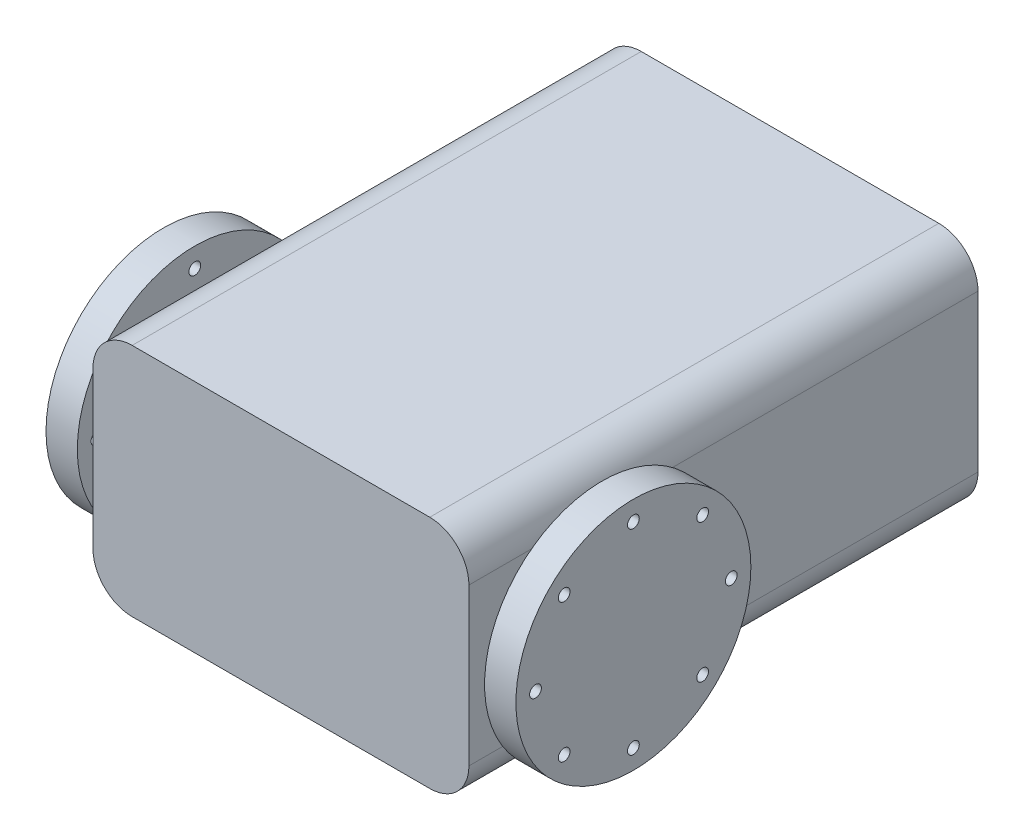
ISO-10303-21;
HEADER;
FILE_DESCRIPTION(('STEP AP214'),'2;1');
FILE_NAME('part.step','',(''),(''),'','','');
FILE_SCHEMA(('AUTOMOTIVE_DESIGN { 1 0 10303 214 1 1 1 1 }'));
ENDSEC;
DATA;
#1=APPLICATION_CONTEXT('core data for automotive mechanical design processes');
#2=APPLICATION_PROTOCOL_DEFINITION('international standard','automotive_design',2000,#1);
#3=PRODUCT_CONTEXT('',#1,'mechanical');
#4=PRODUCT('Part','Part','',(#3));
#5=PRODUCT_RELATED_PRODUCT_CATEGORY('part','',(#4));
#6=PRODUCT_DEFINITION_FORMATION('','',#4);
#7=PRODUCT_DEFINITION_CONTEXT('part definition',#1,'design');
#8=PRODUCT_DEFINITION('design','',#6,#7);
#9=PRODUCT_DEFINITION_SHAPE('','',#8);
#10=(LENGTH_UNIT() NAMED_UNIT(*) SI_UNIT(.MILLI.,.METRE.));
#11=(NAMED_UNIT(*) PLANE_ANGLE_UNIT() SI_UNIT($,.RADIAN.));
#12=(NAMED_UNIT(*) SI_UNIT($,.STERADIAN.) SOLID_ANGLE_UNIT());
#13=UNCERTAINTY_MEASURE_WITH_UNIT(LENGTH_MEASURE(1.E-05),#10,'distance_accuracy_value','');
#14=(GEOMETRIC_REPRESENTATION_CONTEXT(3) GLOBAL_UNCERTAINTY_ASSIGNED_CONTEXT((#13)) GLOBAL_UNIT_ASSIGNED_CONTEXT((#10,
#11,#12)) REPRESENTATION_CONTEXT('',''));
#15=CARTESIAN_POINT('',(0.,0.,0.));
#16=DIRECTION('',(0.,0.,1.));
#17=DIRECTION('',(1.,0.,0.));
#18=AXIS2_PLACEMENT_3D('',#15,#16,#17);
#19=CARTESIAN_POINT('',(19.,10.,32.5));
#20=DIRECTION('',(0.,0.,-1.));
#21=DIRECTION('',(-1.,0.,0.));
#22=AXIS2_PLACEMENT_3D('',#19,#20,#21);
#23=CYLINDRICAL_SURFACE('',#22,5.);
#24=CARTESIAN_POINT('',(19.,10.,-32.5));
#25=DIRECTION('',(0.,0.,1.));
#26=DIRECTION('',(-1.,0.,0.));
#27=AXIS2_PLACEMENT_3D('',#24,#25,#26);
#28=CIRCLE('',#27,5.);
#29=CARTESIAN_POINT('',(24.,10.,-32.5));
#30=VERTEX_POINT('',#29);
#31=CARTESIAN_POINT('',(19.,15.,-32.5));
#32=VERTEX_POINT('',#31);
#33=EDGE_CURVE('E131',#30,#32,#28,.T.);
#34=ORIENTED_EDGE('',*,*,#33,.T.);
#35=DIRECTION('',(0.,0.,-1.));
#36=VECTOR('',#35,1.);
#37=CARTESIAN_POINT('',(19.,15.,32.5));
#38=LINE('',#37,#36);
#39=CARTESIAN_POINT('',(19.,15.,32.5));
#40=VERTEX_POINT('',#39);
#41=EDGE_CURVE('E42',#40,#32,#38,.T.);
#42=ORIENTED_EDGE('',*,*,#41,.F.);
#43=CARTESIAN_POINT('',(19.,10.,32.5));
#44=DIRECTION('',(0.,0.,1.));
#45=DIRECTION('',(-1.,0.,0.));
#46=AXIS2_PLACEMENT_3D('',#43,#44,#45);
#47=CIRCLE('',#46,5.);
#48=CARTESIAN_POINT('',(24.,10.,32.5));
#49=VERTEX_POINT('',#48);
#50=EDGE_CURVE('E146',#49,#40,#47,.T.);
#51=ORIENTED_EDGE('',*,*,#50,.F.);
#52=DIRECTION('',(0.,0.,-1.));
#53=VECTOR('',#52,1.);
#54=CARTESIAN_POINT('',(24.,10.,32.5));
#55=LINE('',#54,#53);
#56=EDGE_CURVE('E127',#49,#30,#55,.T.);
#57=ORIENTED_EDGE('',*,*,#56,.T.);
#58=EDGE_LOOP('',(#34,#42,#51,#57));
#59=FACE_BOUND('',#58,.T.);
#60=ADVANCED_FACE('F34',(#59),#23,.T.);
#61=CARTESIAN_POINT('',(-19.,15.,32.5));
#62=DIRECTION('',(0.,-1.,0.));
#63=DIRECTION('',(0.,0.,-1.));
#64=AXIS2_PLACEMENT_3D('',#61,#62,#63);
#65=PLANE('',#64);
#66=DIRECTION('',(-1.,0.,0.));
#67=VECTOR('',#66,1.);
#68=CARTESIAN_POINT('',(-19.,15.,-32.5));
#69=LINE('',#68,#67);
#70=CARTESIAN_POINT('',(-19.,15.,-32.5));
#71=VERTEX_POINT('',#70);
#72=EDGE_CURVE('E134',#32,#71,#69,.T.);
#73=ORIENTED_EDGE('',*,*,#72,.T.);
#74=DIRECTION('',(0.,0.,-1.));
#75=VECTOR('',#74,1.);
#76=CARTESIAN_POINT('',(-19.,15.,32.5));
#77=LINE('',#76,#75);
#78=CARTESIAN_POINT('',(-19.,15.,32.5));
#79=VERTEX_POINT('',#78);
#80=EDGE_CURVE('E156',#79,#71,#77,.T.);
#81=ORIENTED_EDGE('',*,*,#80,.F.);
#82=DIRECTION('',(-1.,0.,0.));
#83=VECTOR('',#82,1.);
#84=CARTESIAN_POINT('',(-19.,15.,32.5));
#85=LINE('',#84,#83);
#86=EDGE_CURVE('E94',#40,#79,#85,.T.);
#87=ORIENTED_EDGE('',*,*,#86,.F.);
#88=ORIENTED_EDGE('',*,*,#41,.T.);
#89=EDGE_LOOP('',(#73,#81,#87,#88));
#90=FACE_BOUND('',#89,.T.);
#91=ADVANCED_FACE('F159',(#90),#65,.F.);
#92=CARTESIAN_POINT('',(-19.,10.,32.5));
#93=DIRECTION('',(0.,0.,-1.));
#94=DIRECTION('',(-1.,0.,0.));
#95=AXIS2_PLACEMENT_3D('',#92,#93,#94);
#96=CYLINDRICAL_SURFACE('',#95,5.);
#97=CARTESIAN_POINT('',(-19.,10.,-32.5));
#98=DIRECTION('',(0.,0.,1.));
#99=DIRECTION('',(1.,0.,0.));
#100=AXIS2_PLACEMENT_3D('',#97,#98,#99);
#101=CIRCLE('',#100,5.);
#102=CARTESIAN_POINT('',(-24.,10.,-32.5));
#103=VERTEX_POINT('',#102);
#104=EDGE_CURVE('E137',#71,#103,#101,.T.);
#105=ORIENTED_EDGE('',*,*,#104,.T.);
#106=DIRECTION('',(0.,0.,-1.));
#107=VECTOR('',#106,1.);
#108=CARTESIAN_POINT('',(-24.,10.,32.5));
#109=LINE('',#108,#107);
#110=CARTESIAN_POINT('',(-24.,10.,32.5));
#111=VERTEX_POINT('',#110);
#112=EDGE_CURVE('E153',#111,#103,#109,.T.);
#113=ORIENTED_EDGE('',*,*,#112,.F.);
#114=CARTESIAN_POINT('',(-19.,10.,32.5));
#115=DIRECTION('',(0.,0.,1.));
#116=DIRECTION('',(1.,0.,0.));
#117=AXIS2_PLACEMENT_3D('',#114,#115,#116);
#118=CIRCLE('',#117,5.);
#119=EDGE_CURVE('E177',#79,#111,#118,.T.);
#120=ORIENTED_EDGE('',*,*,#119,.F.);
#121=ORIENTED_EDGE('',*,*,#80,.T.);
#122=EDGE_LOOP('',(#105,#113,#120,#121));
#123=FACE_BOUND('',#122,.T.);
#124=ADVANCED_FACE('F170',(#123),#96,.T.);
#125=CARTESIAN_POINT('',(-24.,-10.,32.5));
#126=DIRECTION('',(1.,0.,0.));
#127=DIRECTION('',(0.,0.,-1.));
#128=AXIS2_PLACEMENT_3D('',#125,#126,#127);
#129=PLANE('',#128);
#130=CARTESIAN_POINT('',(-24.,0.,17.5));
#131=DIRECTION('',(1.,0.,0.));
#132=DIRECTION('',(0.,0.,-1.));
#133=AXIS2_PLACEMENT_3D('',#130,#131,#132);
#134=CIRCLE('',#133,7.5);
#135=CARTESIAN_POINT('',(-24.,0.,10.));
#136=VERTEX_POINT('',#135);
#137=EDGE_CURVE('E189',#136,#136,#134,.T.);
#138=ORIENTED_EDGE('',*,*,#137,.T.);
#139=EDGE_LOOP('',(#138));
#140=FACE_BOUND('',#139,.T.);
#141=DIRECTION('',(0.,-1.,0.));
#142=VECTOR('',#141,1.);
#143=CARTESIAN_POINT('',(-24.,-10.,-32.5));
#144=LINE('',#143,#142);
#145=CARTESIAN_POINT('',(-24.,-10.,-32.5));
#146=VERTEX_POINT('',#145);
#147=EDGE_CURVE('E139',#103,#146,#144,.T.);
#148=ORIENTED_EDGE('',*,*,#147,.T.);
#149=DIRECTION('',(0.,0.,-1.));
#150=VECTOR('',#149,1.);
#151=CARTESIAN_POINT('',(-24.,-10.,32.5));
#152=LINE('',#151,#150);
#153=CARTESIAN_POINT('',(-24.,-10.,32.5));
#154=VERTEX_POINT('',#153);
#155=EDGE_CURVE('E150',#154,#146,#152,.T.);
#156=ORIENTED_EDGE('',*,*,#155,.F.);
#157=DIRECTION('',(0.,-1.,0.));
#158=VECTOR('',#157,1.);
#159=CARTESIAN_POINT('',(-24.,-10.,32.5));
#160=LINE('',#159,#158);
#161=EDGE_CURVE('E176',#111,#154,#160,.T.);
#162=ORIENTED_EDGE('',*,*,#161,.F.);
#163=ORIENTED_EDGE('',*,*,#112,.T.);
#164=EDGE_LOOP('',(#148,#156,#162,#163));
#165=FACE_BOUND('',#164,.T.);
#166=ADVANCED_FACE('F174',(#140,#165),#129,.F.);
#167=CARTESIAN_POINT('',(-19.,-10.,32.5));
#168=DIRECTION('',(0.,0.,-1.));
#169=DIRECTION('',(-1.,0.,0.));
#170=AXIS2_PLACEMENT_3D('',#167,#168,#169);
#171=CYLINDRICAL_SURFACE('',#170,5.);
#172=CARTESIAN_POINT('',(-19.,-10.,-32.5));
#173=DIRECTION('',(0.,0.,1.));
#174=DIRECTION('',(-1.,0.,0.));
#175=AXIS2_PLACEMENT_3D('',#172,#173,#174);
#176=CIRCLE('',#175,5.);
#177=CARTESIAN_POINT('',(-19.,-15.,-32.5));
#178=VERTEX_POINT('',#177);
#179=EDGE_CURVE('E141',#146,#178,#176,.T.);
#180=ORIENTED_EDGE('',*,*,#179,.T.);
#181=DIRECTION('',(0.,0.,-1.));
#182=VECTOR('',#181,1.);
#183=CARTESIAN_POINT('',(-19.,-15.,32.5));
#184=LINE('',#183,#182);
#185=CARTESIAN_POINT('',(-19.,-15.,32.5));
#186=VERTEX_POINT('',#185);
#187=EDGE_CURVE('E122',#186,#178,#184,.T.);
#188=ORIENTED_EDGE('',*,*,#187,.F.);
#189=CARTESIAN_POINT('',(-19.,-10.,32.5));
#190=DIRECTION('',(0.,0.,1.));
#191=DIRECTION('',(-1.,0.,0.));
#192=AXIS2_PLACEMENT_3D('',#189,#190,#191);
#193=CIRCLE('',#192,5.);
#194=EDGE_CURVE('E113',#154,#186,#193,.T.);
#195=ORIENTED_EDGE('',*,*,#194,.F.);
#196=ORIENTED_EDGE('',*,*,#155,.T.);
#197=EDGE_LOOP('',(#180,#188,#195,#196));
#198=FACE_BOUND('',#197,.T.);
#199=ADVANCED_FACE('F347',(#198),#171,.T.);
#200=CARTESIAN_POINT('',(-19.,-15.,32.5));
#201=DIRECTION('',(0.,1.,0.));
#202=DIRECTION('',(0.,0.,1.));
#203=AXIS2_PLACEMENT_3D('',#200,#201,#202);
#204=PLANE('',#203);
#205=DIRECTION('',(1.,0.,0.));
#206=VECTOR('',#205,1.);
#207=CARTESIAN_POINT('',(-19.,-15.,-32.5));
#208=LINE('',#207,#206);
#209=CARTESIAN_POINT('',(19.,-15.,-32.5));
#210=VERTEX_POINT('',#209);
#211=EDGE_CURVE('E121',#178,#210,#208,.T.);
#212=ORIENTED_EDGE('',*,*,#211,.T.);
#213=DIRECTION('',(0.,0.,-1.));
#214=VECTOR('',#213,1.);
#215=CARTESIAN_POINT('',(19.,-15.,32.5));
#216=LINE('',#215,#214);
#217=CARTESIAN_POINT('',(19.,-15.,32.5));
#218=VERTEX_POINT('',#217);
#219=EDGE_CURVE('E118',#218,#210,#216,.T.);
#220=ORIENTED_EDGE('',*,*,#219,.F.);
#221=DIRECTION('',(1.,0.,0.));
#222=VECTOR('',#221,1.);
#223=CARTESIAN_POINT('',(-19.,-15.,32.5));
#224=LINE('',#223,#222);
#225=EDGE_CURVE('E107',#186,#218,#224,.T.);
#226=ORIENTED_EDGE('',*,*,#225,.F.);
#227=ORIENTED_EDGE('',*,*,#187,.T.);
#228=EDGE_LOOP('',(#212,#220,#226,#227));
#229=FACE_BOUND('',#228,.T.);
#230=ADVANCED_FACE('F119',(#229),#204,.F.);
#231=CARTESIAN_POINT('',(19.,-10.,32.5));
#232=DIRECTION('',(0.,0.,-1.));
#233=DIRECTION('',(-1.,0.,0.));
#234=AXIS2_PLACEMENT_3D('',#231,#232,#233);
#235=CYLINDRICAL_SURFACE('',#234,5.);
#236=CARTESIAN_POINT('',(19.,-10.,-32.5));
#237=DIRECTION('',(0.,0.,1.));
#238=DIRECTION('',(1.,0.,0.));
#239=AXIS2_PLACEMENT_3D('',#236,#237,#238);
#240=CIRCLE('',#239,5.);
#241=CARTESIAN_POINT('',(24.,-10.,-32.5));
#242=VERTEX_POINT('',#241);
#243=EDGE_CURVE('E79',#210,#242,#240,.T.);
#244=ORIENTED_EDGE('',*,*,#243,.T.);
#245=DIRECTION('',(0.,0.,-1.));
#246=VECTOR('',#245,1.);
#247=CARTESIAN_POINT('',(24.,-10.,32.5));
#248=LINE('',#247,#246);
#249=CARTESIAN_POINT('',(24.,-10.,32.5));
#250=VERTEX_POINT('',#249);
#251=EDGE_CURVE('E123',#250,#242,#248,.T.);
#252=ORIENTED_EDGE('',*,*,#251,.F.);
#253=CARTESIAN_POINT('',(19.,-10.,32.5));
#254=DIRECTION('',(0.,0.,1.));
#255=DIRECTION('',(1.,0.,0.));
#256=AXIS2_PLACEMENT_3D('',#253,#254,#255);
#257=CIRCLE('',#256,5.);
#258=EDGE_CURVE('E111',#218,#250,#257,.T.);
#259=ORIENTED_EDGE('',*,*,#258,.F.);
#260=ORIENTED_EDGE('',*,*,#219,.T.);
#261=EDGE_LOOP('',(#244,#252,#259,#260));
#262=FACE_BOUND('',#261,.T.);
#263=ADVANCED_FACE('F125',(#262),#235,.T.);
#264=CARTESIAN_POINT('',(24.,-10.,32.5));
#265=DIRECTION('',(-1.,0.,0.));
#266=DIRECTION('',(0.,0.,1.));
#267=AXIS2_PLACEMENT_3D('',#264,#265,#266);
#268=PLANE('',#267);
#269=CARTESIAN_POINT('',(24.,0.,17.5));
#270=DIRECTION('',(-1.,0.,0.));
#271=DIRECTION('',(0.,0.,1.));
#272=AXIS2_PLACEMENT_3D('',#269,#270,#271);
#273=CIRCLE('',#272,7.5);
#274=CARTESIAN_POINT('',(24.,0.,25.));
#275=VERTEX_POINT('',#274);
#276=EDGE_CURVE('E11',#275,#275,#273,.F.);
#277=ORIENTED_EDGE('',*,*,#276,.F.);
#278=EDGE_LOOP('',(#277));
#279=FACE_BOUND('',#278,.T.);
#280=DIRECTION('',(0.,1.,0.));
#281=VECTOR('',#280,1.);
#282=CARTESIAN_POINT('',(24.,-10.,-32.5));
#283=LINE('',#282,#281);
#284=EDGE_CURVE('E85',#242,#30,#283,.T.);
#285=ORIENTED_EDGE('',*,*,#284,.T.);
#286=ORIENTED_EDGE('',*,*,#56,.F.);
#287=DIRECTION('',(0.,1.,0.));
#288=VECTOR('',#287,1.);
#289=CARTESIAN_POINT('',(24.,-10.,32.5));
#290=LINE('',#289,#288);
#291=EDGE_CURVE('E50',#250,#49,#290,.T.);
#292=ORIENTED_EDGE('',*,*,#291,.F.);
#293=ORIENTED_EDGE('',*,*,#251,.T.);
#294=EDGE_LOOP('',(#285,#286,#292,#293));
#295=FACE_BOUND('',#294,.T.);
#296=ADVANCED_FACE('F356',(#279,#295),#268,.F.);
#297=CARTESIAN_POINT('',(19.,10.,32.5));
#298=DIRECTION('',(0.,0.,-1.));
#299=DIRECTION('',(-1.,0.,0.));
#300=AXIS2_PLACEMENT_3D('',#297,#298,#299);
#301=PLANE('',#300);
#302=ORIENTED_EDGE('',*,*,#50,.T.);
#303=ORIENTED_EDGE('',*,*,#86,.T.);
#304=ORIENTED_EDGE('',*,*,#119,.T.);
#305=ORIENTED_EDGE('',*,*,#161,.T.);
#306=ORIENTED_EDGE('',*,*,#194,.T.);
#307=ORIENTED_EDGE('',*,*,#225,.T.);
#308=ORIENTED_EDGE('',*,*,#258,.T.);
#309=ORIENTED_EDGE('',*,*,#291,.T.);
#310=EDGE_LOOP('',(#302,#303,#304,#305,#306,#307,#308,#309));
#311=FACE_BOUND('',#310,.T.);
#312=ADVANCED_FACE('F109',(#311),#301,.F.);
#313=CARTESIAN_POINT('',(19.,10.,-32.5));
#314=DIRECTION('',(0.,0.,-1.));
#315=DIRECTION('',(-1.,0.,0.));
#316=AXIS2_PLACEMENT_3D('',#313,#314,#315);
#317=PLANE('',#316);
#318=ORIENTED_EDGE('',*,*,#33,.F.);
#319=ORIENTED_EDGE('',*,*,#284,.F.);
#320=ORIENTED_EDGE('',*,*,#243,.F.);
#321=ORIENTED_EDGE('',*,*,#211,.F.);
#322=ORIENTED_EDGE('',*,*,#179,.F.);
#323=ORIENTED_EDGE('',*,*,#147,.F.);
#324=ORIENTED_EDGE('',*,*,#104,.F.);
#325=ORIENTED_EDGE('',*,*,#72,.F.);
#326=EDGE_LOOP('',(#318,#319,#320,#321,#322,#323,#324,#325));
#327=FACE_BOUND('',#326,.T.);
#328=ADVANCED_FACE('F164',(#327),#317,.T.);
#329=CARTESIAN_POINT('',(2.78679656440357,0.,17.5));
#330=DIRECTION('',(1.,0.,0.));
#331=DIRECTION('',(0.,0.,-1.));
#332=AXIS2_PLACEMENT_3D('',#329,#330,#331);
#333=CYLINDRICAL_SURFACE('',#332,7.5);
#334=CARTESIAN_POINT('',(26.,0.,17.5));
#335=DIRECTION('',(1.,0.,0.));
#336=DIRECTION('',(0.,0.,-1.));
#337=AXIS2_PLACEMENT_3D('',#334,#335,#336);
#338=CIRCLE('',#337,7.5);
#339=CARTESIAN_POINT('',(26.,0.,10.));
#340=VERTEX_POINT('',#339);
#341=EDGE_CURVE('E135',#340,#340,#338,.T.);
#342=ORIENTED_EDGE('',*,*,#341,.F.);
#343=EDGE_LOOP('',(#342));
#344=FACE_BOUND('',#343,.T.);
#345=ORIENTED_EDGE('',*,*,#276,.T.);
#346=EDGE_LOOP('',(#345));
#347=FACE_BOUND('',#346,.T.);
#348=ADVANCED_FACE('F362',(#344,#347),#333,.T.);
#349=CARTESIAN_POINT('',(30.,0.,17.5));
#350=DIRECTION('',(-1.,0.,0.));
#351=DIRECTION('',(0.,0.,1.));
#352=AXIS2_PLACEMENT_3D('',#349,#350,#351);
#353=CYLINDRICAL_SURFACE('',#352,15.);
#354=CARTESIAN_POINT('',(30.,0.,17.5));
#355=DIRECTION('',(1.,0.,0.));
#356=DIRECTION('',(0.,0.,-1.));
#357=AXIS2_PLACEMENT_3D('',#354,#355,#356);
#358=CIRCLE('',#357,15.);
#359=CARTESIAN_POINT('',(30.,0.,2.5));
#360=VERTEX_POINT('',#359);
#361=EDGE_CURVE('E185',#360,#360,#358,.T.);
#362=ORIENTED_EDGE('',*,*,#361,.F.);
#363=EDGE_LOOP('',(#362));
#364=FACE_BOUND('',#363,.T.);
#365=CARTESIAN_POINT('',(26.,0.,17.5));
#366=DIRECTION('',(1.,0.,0.));
#367=DIRECTION('',(0.,0.,-1.));
#368=AXIS2_PLACEMENT_3D('',#365,#366,#367);
#369=CIRCLE('',#368,15.);
#370=CARTESIAN_POINT('',(26.,0.,2.5));
#371=VERTEX_POINT('',#370);
#372=EDGE_CURVE('E186',#371,#371,#369,.T.);
#373=ORIENTED_EDGE('',*,*,#372,.T.);
#374=EDGE_LOOP('',(#373));
#375=FACE_BOUND('',#374,.T.);
#376=ADVANCED_FACE('F367',(#364,#375),#353,.T.);
#377=CARTESIAN_POINT('',(30.,0.,17.5));
#378=DIRECTION('',(1.,0.,0.));
#379=DIRECTION('',(0.,0.,-1.));
#380=AXIS2_PLACEMENT_3D('',#377,#378,#379);
#381=PLANE('',#380);
#382=CARTESIAN_POINT('',(30.,-8.83883476483185,26.3388347648318));
#383=DIRECTION('',(1.,0.,0.));
#384=DIRECTION('',(0.,0.,-1.));
#385=AXIS2_PLACEMENT_3D('',#382,#383,#384);
#386=CIRCLE('',#385,0.750000000000002);
#387=CARTESIAN_POINT('',(30.,-8.83883476483185,25.5888347648318));
#388=VERTEX_POINT('',#387);
#389=EDGE_CURVE('E228',#388,#388,#386,.T.);
#390=ORIENTED_EDGE('',*,*,#389,.F.);
#391=EDGE_LOOP('',(#390));
#392=FACE_BOUND('',#391,.T.);
#393=CARTESIAN_POINT('',(30.,-12.5,17.5));
#394=DIRECTION('',(1.,0.,0.));
#395=DIRECTION('',(0.,0.,-1.));
#396=AXIS2_PLACEMENT_3D('',#393,#394,#395);
#397=CIRCLE('',#396,0.750000000000005);
#398=CARTESIAN_POINT('',(30.,-12.5,16.75));
#399=VERTEX_POINT('',#398);
#400=EDGE_CURVE('E236',#399,#399,#397,.T.);
#401=ORIENTED_EDGE('',*,*,#400,.F.);
#402=EDGE_LOOP('',(#401));
#403=FACE_BOUND('',#402,.T.);
#404=CARTESIAN_POINT('',(30.,-8.83883476483184,8.66116523516816));
#405=DIRECTION('',(1.,0.,0.));
#406=DIRECTION('',(0.,0.,-1.));
#407=AXIS2_PLACEMENT_3D('',#404,#405,#406);
#408=CIRCLE('',#407,0.750000000000002);
#409=CARTESIAN_POINT('',(30.,-8.83883476483184,7.91116523516816));
#410=VERTEX_POINT('',#409);
#411=EDGE_CURVE('E242',#410,#410,#408,.T.);
#412=ORIENTED_EDGE('',*,*,#411,.F.);
#413=EDGE_LOOP('',(#412));
#414=FACE_BOUND('',#413,.T.);
#415=CARTESIAN_POINT('',(30.,0.,5.));
#416=DIRECTION('',(1.,0.,0.));
#417=DIRECTION('',(0.,0.,-1.));
#418=AXIS2_PLACEMENT_3D('',#415,#416,#417);
#419=CIRCLE('',#418,0.750000000000001);
#420=CARTESIAN_POINT('',(30.,0.,4.25));
#421=VERTEX_POINT('',#420);
#422=EDGE_CURVE('E217',#421,#421,#419,.T.);
#423=ORIENTED_EDGE('',*,*,#422,.F.);
#424=EDGE_LOOP('',(#423));
#425=FACE_BOUND('',#424,.T.);
#426=CARTESIAN_POINT('',(30.,8.83883476483185,8.66116523516816));
#427=DIRECTION('',(1.,0.,0.));
#428=DIRECTION('',(0.,0.,-1.));
#429=AXIS2_PLACEMENT_3D('',#426,#427,#428);
#430=CIRCLE('',#429,0.750000000000002);
#431=CARTESIAN_POINT('',(30.,8.83883476483185,7.91116523516816));
#432=VERTEX_POINT('',#431);
#433=EDGE_CURVE('E210',#432,#432,#430,.T.);
#434=ORIENTED_EDGE('',*,*,#433,.F.);
#435=EDGE_LOOP('',(#434));
#436=FACE_BOUND('',#435,.T.);
#437=CARTESIAN_POINT('',(30.,12.5,17.5));
#438=DIRECTION('',(1.,0.,0.));
#439=DIRECTION('',(0.,0.,-1.));
#440=AXIS2_PLACEMENT_3D('',#437,#438,#439);
#441=CIRCLE('',#440,0.750000000000002);
#442=CARTESIAN_POINT('',(30.,12.5,16.75));
#443=VERTEX_POINT('',#442);
#444=EDGE_CURVE('E218',#443,#443,#441,.T.);
#445=ORIENTED_EDGE('',*,*,#444,.F.);
#446=EDGE_LOOP('',(#445));
#447=FACE_BOUND('',#446,.T.);
#448=CARTESIAN_POINT('',(30.,0.,30.));
#449=DIRECTION('',(1.,0.,0.));
#450=DIRECTION('',(0.,0.,-1.));
#451=AXIS2_PLACEMENT_3D('',#448,#449,#450);
#452=CIRCLE('',#451,0.750000000000002);
#453=CARTESIAN_POINT('',(30.,0.,29.25));
#454=VERTEX_POINT('',#453);
#455=EDGE_CURVE('E209',#454,#454,#452,.T.);
#456=ORIENTED_EDGE('',*,*,#455,.F.);
#457=EDGE_LOOP('',(#456));
#458=FACE_BOUND('',#457,.T.);
#459=CARTESIAN_POINT('',(30.,8.83883476483184,26.3388347648318));
#460=DIRECTION('',(1.,0.,0.));
#461=DIRECTION('',(0.,0.,-1.));
#462=AXIS2_PLACEMENT_3D('',#459,#460,#461);
#463=CIRCLE('',#462,0.750000000000005);
#464=CARTESIAN_POINT('',(30.,8.83883476483184,25.5888347648318));
#465=VERTEX_POINT('',#464);
#466=EDGE_CURVE('E206',#465,#465,#463,.T.);
#467=ORIENTED_EDGE('',*,*,#466,.F.);
#468=EDGE_LOOP('',(#467));
#469=FACE_BOUND('',#468,.T.);
#470=ORIENTED_EDGE('',*,*,#361,.T.);
#471=EDGE_LOOP('',(#470));
#472=FACE_BOUND('',#471,.T.);
#473=ADVANCED_FACE('F371',(#392,#403,#414,#425,#436,#447,#458,#469,#472),#381,.T.);
#474=CARTESIAN_POINT('',(26.,0.,17.5));
#475=DIRECTION('',(1.,0.,0.));
#476=DIRECTION('',(0.,0.,-1.));
#477=AXIS2_PLACEMENT_3D('',#474,#475,#476);
#478=PLANE('',#477);
#479=CARTESIAN_POINT('',(26.,-8.83883476483185,26.3388347648318));
#480=DIRECTION('',(1.,0.,0.));
#481=DIRECTION('',(0.,0.,-1.));
#482=AXIS2_PLACEMENT_3D('',#479,#480,#481);
#483=CIRCLE('',#482,0.750000000000002);
#484=CARTESIAN_POINT('',(26.,-8.83883476483185,25.5888347648318));
#485=VERTEX_POINT('',#484);
#486=EDGE_CURVE('E232',#485,#485,#483,.F.);
#487=ORIENTED_EDGE('',*,*,#486,.F.);
#488=EDGE_LOOP('',(#487));
#489=FACE_BOUND('',#488,.T.);
#490=CARTESIAN_POINT('',(26.,-12.5,17.5));
#491=DIRECTION('',(1.,0.,0.));
#492=DIRECTION('',(0.,0.,-1.));
#493=AXIS2_PLACEMENT_3D('',#490,#491,#492);
#494=CIRCLE('',#493,0.750000000000005);
#495=CARTESIAN_POINT('',(26.,-12.5,16.75));
#496=VERTEX_POINT('',#495);
#497=EDGE_CURVE('E231',#496,#496,#494,.F.);
#498=ORIENTED_EDGE('',*,*,#497,.F.);
#499=EDGE_LOOP('',(#498));
#500=FACE_BOUND('',#499,.T.);
#501=CARTESIAN_POINT('',(26.,-8.83883476483184,8.66116523516816));
#502=DIRECTION('',(1.,0.,0.));
#503=DIRECTION('',(0.,0.,-1.));
#504=AXIS2_PLACEMENT_3D('',#501,#502,#503);
#505=CIRCLE('',#504,0.750000000000002);
#506=CARTESIAN_POINT('',(26.,-8.83883476483184,7.91116523516816));
#507=VERTEX_POINT('',#506);
#508=EDGE_CURVE('E239',#507,#507,#505,.F.);
#509=ORIENTED_EDGE('',*,*,#508,.F.);
#510=EDGE_LOOP('',(#509));
#511=FACE_BOUND('',#510,.T.);
#512=CARTESIAN_POINT('',(26.,0.,5.));
#513=DIRECTION('',(1.,0.,0.));
#514=DIRECTION('',(0.,0.,-1.));
#515=AXIS2_PLACEMENT_3D('',#512,#513,#514);
#516=CIRCLE('',#515,0.750000000000001);
#517=CARTESIAN_POINT('',(26.,0.,4.25));
#518=VERTEX_POINT('',#517);
#519=EDGE_CURVE('E245',#518,#518,#516,.F.);
#520=ORIENTED_EDGE('',*,*,#519,.F.);
#521=EDGE_LOOP('',(#520));
#522=FACE_BOUND('',#521,.T.);
#523=CARTESIAN_POINT('',(26.,8.83883476483185,8.66116523516816));
#524=DIRECTION('',(1.,0.,0.));
#525=DIRECTION('',(0.,0.,-1.));
#526=AXIS2_PLACEMENT_3D('',#523,#524,#525);
#527=CIRCLE('',#526,0.750000000000002);
#528=CARTESIAN_POINT('',(26.,8.83883476483185,7.91116523516816));
#529=VERTEX_POINT('',#528);
#530=EDGE_CURVE('E214',#529,#529,#527,.F.);
#531=ORIENTED_EDGE('',*,*,#530,.F.);
#532=EDGE_LOOP('',(#531));
#533=FACE_BOUND('',#532,.T.);
#534=CARTESIAN_POINT('',(26.,12.5,17.5));
#535=DIRECTION('',(1.,0.,0.));
#536=DIRECTION('',(0.,0.,-1.));
#537=AXIS2_PLACEMENT_3D('',#534,#535,#536);
#538=CIRCLE('',#537,0.750000000000002);
#539=CARTESIAN_POINT('',(26.,12.5,16.75));
#540=VERTEX_POINT('',#539);
#541=EDGE_CURVE('E213',#540,#540,#538,.F.);
#542=ORIENTED_EDGE('',*,*,#541,.F.);
#543=EDGE_LOOP('',(#542));
#544=FACE_BOUND('',#543,.T.);
#545=CARTESIAN_POINT('',(26.,0.,30.));
#546=DIRECTION('',(1.,0.,0.));
#547=DIRECTION('',(0.,0.,-1.));
#548=AXIS2_PLACEMENT_3D('',#545,#546,#547);
#549=CIRCLE('',#548,0.750000000000002);
#550=CARTESIAN_POINT('',(26.,0.,29.25));
#551=VERTEX_POINT('',#550);
#552=EDGE_CURVE('E221',#551,#551,#549,.F.);
#553=ORIENTED_EDGE('',*,*,#552,.F.);
#554=EDGE_LOOP('',(#553));
#555=FACE_BOUND('',#554,.T.);
#556=CARTESIAN_POINT('',(26.,8.83883476483184,26.3388347648318));
#557=DIRECTION('',(1.,0.,0.));
#558=DIRECTION('',(0.,0.,-1.));
#559=AXIS2_PLACEMENT_3D('',#556,#557,#558);
#560=CIRCLE('',#559,0.750000000000005);
#561=CARTESIAN_POINT('',(26.,8.83883476483184,25.5888347648318));
#562=VERTEX_POINT('',#561);
#563=EDGE_CURVE('E201',#562,#562,#560,.F.);
#564=ORIENTED_EDGE('',*,*,#563,.F.);
#565=EDGE_LOOP('',(#564));
#566=FACE_BOUND('',#565,.T.);
#567=ORIENTED_EDGE('',*,*,#341,.T.);
#568=EDGE_LOOP('',(#567));
#569=FACE_BOUND('',#568,.T.);
#570=ORIENTED_EDGE('',*,*,#372,.F.);
#571=EDGE_LOOP('',(#570));
#572=FACE_BOUND('',#571,.T.);
#573=ADVANCED_FACE('F373',(#489,#500,#511,#522,#533,#544,#555,#566,#569,#572),#478,.F.);
#574=CARTESIAN_POINT('',(45.2132034355964,0.,17.5));
#575=DIRECTION('',(-1.,0.,0.));
#576=DIRECTION('',(0.,0.,1.));
#577=AXIS2_PLACEMENT_3D('',#574,#575,#576);
#578=CYLINDRICAL_SURFACE('',#577,7.5);
#579=CARTESIAN_POINT('',(-26.,0.,17.5));
#580=DIRECTION('',(-1.,0.,0.));
#581=DIRECTION('',(0.,0.,1.));
#582=AXIS2_PLACEMENT_3D('',#579,#580,#581);
#583=CIRCLE('',#582,7.5);
#584=CARTESIAN_POINT('',(-26.,0.,25.));
#585=VERTEX_POINT('',#584);
#586=EDGE_CURVE('E194',#585,#585,#583,.T.);
#587=ORIENTED_EDGE('',*,*,#586,.F.);
#588=EDGE_LOOP('',(#587));
#589=FACE_BOUND('',#588,.T.);
#590=ORIENTED_EDGE('',*,*,#137,.F.);
#591=EDGE_LOOP('',(#590));
#592=FACE_BOUND('',#591,.T.);
#593=ADVANCED_FACE('F321',(#589,#592),#578,.T.);
#594=CARTESIAN_POINT('',(-30.,0.,17.5));
#595=DIRECTION('',(1.,0.,0.));
#596=DIRECTION('',(0.,0.,-1.));
#597=AXIS2_PLACEMENT_3D('',#594,#595,#596);
#598=CYLINDRICAL_SURFACE('',#597,15.);
#599=CARTESIAN_POINT('',(-30.,0.,17.5));
#600=DIRECTION('',(-1.,0.,0.));
#601=DIRECTION('',(0.,0.,1.));
#602=AXIS2_PLACEMENT_3D('',#599,#600,#601);
#603=CIRCLE('',#602,15.);
#604=CARTESIAN_POINT('',(-30.,0.,32.5));
#605=VERTEX_POINT('',#604);
#606=EDGE_CURVE('E197',#605,#605,#603,.T.);
#607=ORIENTED_EDGE('',*,*,#606,.F.);
#608=EDGE_LOOP('',(#607));
#609=FACE_BOUND('',#608,.T.);
#610=CARTESIAN_POINT('',(-26.,0.,17.5));
#611=DIRECTION('',(-1.,0.,0.));
#612=DIRECTION('',(0.,0.,1.));
#613=AXIS2_PLACEMENT_3D('',#610,#611,#612);
#614=CIRCLE('',#613,15.);
#615=CARTESIAN_POINT('',(-26.,0.,32.5));
#616=VERTEX_POINT('',#615);
#617=EDGE_CURVE('E198',#616,#616,#614,.T.);
#618=ORIENTED_EDGE('',*,*,#617,.T.);
#619=EDGE_LOOP('',(#618));
#620=FACE_BOUND('',#619,.T.);
#621=ADVANCED_FACE('F306',(#609,#620),#598,.T.);
#622=CARTESIAN_POINT('',(-30.,0.,17.5));
#623=DIRECTION('',(-1.,0.,0.));
#624=DIRECTION('',(0.,0.,1.));
#625=AXIS2_PLACEMENT_3D('',#622,#623,#624);
#626=PLANE('',#625);
#627=CARTESIAN_POINT('',(-30.,0.,5.00000000000001));
#628=DIRECTION('',(-1.,0.,0.));
#629=DIRECTION('',(0.,0.,1.));
#630=AXIS2_PLACEMENT_3D('',#627,#628,#629);
#631=CIRCLE('',#630,0.75);
#632=CARTESIAN_POINT('',(-30.,0.,5.75000000000001));
#633=VERTEX_POINT('',#632);
#634=EDGE_CURVE('E279',#633,#633,#631,.T.);
#635=ORIENTED_EDGE('',*,*,#634,.F.);
#636=EDGE_LOOP('',(#635));
#637=FACE_BOUND('',#636,.T.);
#638=CARTESIAN_POINT('',(-30.,-8.83883476483184,8.66116523516816));
#639=DIRECTION('',(-1.,0.,0.));
#640=DIRECTION('',(0.,0.,1.));
#641=AXIS2_PLACEMENT_3D('',#638,#639,#640);
#642=CIRCLE('',#641,0.750000000000004);
#643=CARTESIAN_POINT('',(-30.,-8.83883476483184,9.41116523516816));
#644=VERTEX_POINT('',#643);
#645=EDGE_CURVE('E285',#644,#644,#642,.T.);
#646=ORIENTED_EDGE('',*,*,#645,.F.);
#647=EDGE_LOOP('',(#646));
#648=FACE_BOUND('',#647,.T.);
#649=CARTESIAN_POINT('',(-30.,-12.5,17.5));
#650=DIRECTION('',(-1.,0.,0.));
#651=DIRECTION('',(0.,0.,1.));
#652=AXIS2_PLACEMENT_3D('',#649,#650,#651);
#653=CIRCLE('',#652,0.750000000000005);
#654=CARTESIAN_POINT('',(-30.,-12.5,18.25));
#655=VERTEX_POINT('',#654);
#656=EDGE_CURVE('E291',#655,#655,#653,.T.);
#657=ORIENTED_EDGE('',*,*,#656,.F.);
#658=EDGE_LOOP('',(#657));
#659=FACE_BOUND('',#658,.T.);
#660=CARTESIAN_POINT('',(-30.,-8.83883476483184,26.3388347648318));
#661=DIRECTION('',(-1.,0.,0.));
#662=DIRECTION('',(0.,0.,1.));
#663=AXIS2_PLACEMENT_3D('',#660,#661,#662);
#664=CIRCLE('',#663,0.750000000000002);
#665=CARTESIAN_POINT('',(-30.,-8.83883476483184,27.0888347648318));
#666=VERTEX_POINT('',#665);
#667=EDGE_CURVE('E262',#666,#666,#664,.T.);
#668=ORIENTED_EDGE('',*,*,#667,.F.);
#669=EDGE_LOOP('',(#668));
#670=FACE_BOUND('',#669,.T.);
#671=CARTESIAN_POINT('',(-30.,0.,30.));
#672=DIRECTION('',(-1.,0.,0.));
#673=DIRECTION('',(0.,0.,1.));
#674=AXIS2_PLACEMENT_3D('',#671,#672,#673);
#675=CIRCLE('',#674,0.749999999999998);
#676=CARTESIAN_POINT('',(-30.,0.,30.75));
#677=VERTEX_POINT('',#676);
#678=EDGE_CURVE('E261',#677,#677,#675,.T.);
#679=ORIENTED_EDGE('',*,*,#678,.F.);
#680=EDGE_LOOP('',(#679));
#681=FACE_BOUND('',#680,.T.);
#682=CARTESIAN_POINT('',(-30.,8.83883476483184,26.3388347648318));
#683=DIRECTION('',(-1.,0.,0.));
#684=DIRECTION('',(0.,0.,1.));
#685=AXIS2_PLACEMENT_3D('',#682,#683,#684);
#686=CIRCLE('',#685,0.750000000000002);
#687=CARTESIAN_POINT('',(-30.,8.83883476483184,27.0888347648318));
#688=VERTEX_POINT('',#687);
#689=EDGE_CURVE('E268',#688,#688,#686,.T.);
#690=ORIENTED_EDGE('',*,*,#689,.F.);
#691=EDGE_LOOP('',(#690));
#692=FACE_BOUND('',#691,.T.);
#693=CARTESIAN_POINT('',(-30.,12.5,17.5));
#694=DIRECTION('',(-1.,0.,0.));
#695=DIRECTION('',(0.,0.,1.));
#696=AXIS2_PLACEMENT_3D('',#693,#694,#695);
#697=CIRCLE('',#696,0.750000000000002);
#698=CARTESIAN_POINT('',(-30.,12.5,18.25));
#699=VERTEX_POINT('',#698);
#700=EDGE_CURVE('E255',#699,#699,#697,.T.);
#701=ORIENTED_EDGE('',*,*,#700,.F.);
#702=EDGE_LOOP('',(#701));
#703=FACE_BOUND('',#702,.T.);
#704=CARTESIAN_POINT('',(-30.,8.83883476483184,8.66116523516816));
#705=DIRECTION('',(-1.,0.,0.));
#706=DIRECTION('',(0.,0.,1.));
#707=AXIS2_PLACEMENT_3D('',#704,#705,#706);
#708=CIRCLE('',#707,0.75);
#709=CARTESIAN_POINT('',(-30.,8.83883476483184,9.41116523516816));
#710=VERTEX_POINT('',#709);
#711=EDGE_CURVE('E252',#710,#710,#708,.T.);
#712=ORIENTED_EDGE('',*,*,#711,.F.);
#713=EDGE_LOOP('',(#712));
#714=FACE_BOUND('',#713,.T.);
#715=ORIENTED_EDGE('',*,*,#606,.T.);
#716=EDGE_LOOP('',(#715));
#717=FACE_BOUND('',#716,.T.);
#718=ADVANCED_FACE('F302',(#637,#648,#659,#670,#681,#692,#703,#714,#717),#626,.T.);
#719=CARTESIAN_POINT('',(-26.,0.,17.5));
#720=DIRECTION('',(-1.,0.,0.));
#721=DIRECTION('',(0.,0.,1.));
#722=AXIS2_PLACEMENT_3D('',#719,#720,#721);
#723=PLANE('',#722);
#724=CARTESIAN_POINT('',(-26.,0.,5.00000000000001));
#725=DIRECTION('',(-1.,0.,0.));
#726=DIRECTION('',(0.,0.,1.));
#727=AXIS2_PLACEMENT_3D('',#724,#725,#726);
#728=CIRCLE('',#727,0.75);
#729=CARTESIAN_POINT('',(-26.,0.,5.75000000000001));
#730=VERTEX_POINT('',#729);
#731=EDGE_CURVE('E276',#730,#730,#728,.T.);
#732=ORIENTED_EDGE('',*,*,#731,.T.);
#733=EDGE_LOOP('',(#732));
#734=FACE_BOUND('',#733,.T.);
#735=CARTESIAN_POINT('',(-26.,-8.83883476483184,8.66116523516816));
#736=DIRECTION('',(-1.,0.,0.));
#737=DIRECTION('',(0.,0.,1.));
#738=AXIS2_PLACEMENT_3D('',#735,#736,#737);
#739=CIRCLE('',#738,0.750000000000004);
#740=CARTESIAN_POINT('',(-26.,-8.83883476483184,9.41116523516816));
#741=VERTEX_POINT('',#740);
#742=EDGE_CURVE('E282',#741,#741,#739,.T.);
#743=ORIENTED_EDGE('',*,*,#742,.T.);
#744=EDGE_LOOP('',(#743));
#745=FACE_BOUND('',#744,.T.);
#746=CARTESIAN_POINT('',(-26.,-12.5,17.5));
#747=DIRECTION('',(-1.,0.,0.));
#748=DIRECTION('',(0.,0.,1.));
#749=AXIS2_PLACEMENT_3D('',#746,#747,#748);
#750=CIRCLE('',#749,0.750000000000005);
#751=CARTESIAN_POINT('',(-26.,-12.5,18.25));
#752=VERTEX_POINT('',#751);
#753=EDGE_CURVE('E288',#752,#752,#750,.T.);
#754=ORIENTED_EDGE('',*,*,#753,.T.);
#755=EDGE_LOOP('',(#754));
#756=FACE_BOUND('',#755,.T.);
#757=CARTESIAN_POINT('',(-26.,-8.83883476483184,26.3388347648318));
#758=DIRECTION('',(-1.,0.,0.));
#759=DIRECTION('',(0.,0.,1.));
#760=AXIS2_PLACEMENT_3D('',#757,#758,#759);
#761=CIRCLE('',#760,0.750000000000002);
#762=CARTESIAN_POINT('',(-26.,-8.83883476483184,27.0888347648318));
#763=VERTEX_POINT('',#762);
#764=EDGE_CURVE('E294',#763,#763,#761,.T.);
#765=ORIENTED_EDGE('',*,*,#764,.T.);
#766=EDGE_LOOP('',(#765));
#767=FACE_BOUND('',#766,.T.);
#768=CARTESIAN_POINT('',(-26.,0.,30.));
#769=DIRECTION('',(-1.,0.,0.));
#770=DIRECTION('',(0.,0.,1.));
#771=AXIS2_PLACEMENT_3D('',#768,#769,#770);
#772=CIRCLE('',#771,0.749999999999998);
#773=CARTESIAN_POINT('',(-26.,0.,30.75));
#774=VERTEX_POINT('',#773);
#775=EDGE_CURVE('E258',#774,#774,#772,.T.);
#776=ORIENTED_EDGE('',*,*,#775,.T.);
#777=EDGE_LOOP('',(#776));
#778=FACE_BOUND('',#777,.T.);
#779=CARTESIAN_POINT('',(-26.,8.83883476483184,26.3388347648318));
#780=DIRECTION('',(-1.,0.,0.));
#781=DIRECTION('',(0.,0.,1.));
#782=AXIS2_PLACEMENT_3D('',#779,#780,#781);
#783=CIRCLE('',#782,0.750000000000002);
#784=CARTESIAN_POINT('',(-26.,8.83883476483184,27.0888347648318));
#785=VERTEX_POINT('',#784);
#786=EDGE_CURVE('E265',#785,#785,#783,.T.);
#787=ORIENTED_EDGE('',*,*,#786,.T.);
#788=EDGE_LOOP('',(#787));
#789=FACE_BOUND('',#788,.T.);
#790=CARTESIAN_POINT('',(-26.,12.5,17.5));
#791=DIRECTION('',(-1.,0.,0.));
#792=DIRECTION('',(0.,0.,1.));
#793=AXIS2_PLACEMENT_3D('',#790,#791,#792);
#794=CIRCLE('',#793,0.750000000000002);
#795=CARTESIAN_POINT('',(-26.,12.5,18.25));
#796=VERTEX_POINT('',#795);
#797=EDGE_CURVE('E271',#796,#796,#794,.T.);
#798=ORIENTED_EDGE('',*,*,#797,.T.);
#799=EDGE_LOOP('',(#798));
#800=FACE_BOUND('',#799,.T.);
#801=CARTESIAN_POINT('',(-26.,8.83883476483184,8.66116523516816));
#802=DIRECTION('',(-1.,0.,0.));
#803=DIRECTION('',(0.,0.,1.));
#804=AXIS2_PLACEMENT_3D('',#801,#802,#803);
#805=CIRCLE('',#804,0.75);
#806=CARTESIAN_POINT('',(-26.,8.83883476483184,9.41116523516816));
#807=VERTEX_POINT('',#806);
#808=EDGE_CURVE('E235',#807,#807,#805,.T.);
#809=ORIENTED_EDGE('',*,*,#808,.T.);
#810=EDGE_LOOP('',(#809));
#811=FACE_BOUND('',#810,.T.);
#812=ORIENTED_EDGE('',*,*,#586,.T.);
#813=EDGE_LOOP('',(#812));
#814=FACE_BOUND('',#813,.T.);
#815=ORIENTED_EDGE('',*,*,#617,.F.);
#816=EDGE_LOOP('',(#815));
#817=FACE_BOUND('',#816,.T.);
#818=ADVANCED_FACE('F305',(#734,#745,#756,#767,#778,#789,#800,#811,#814,#817),#723,.F.);
#819=CARTESIAN_POINT('',(23.8786796564403,8.83883476483184,26.3388347648318));
#820=DIRECTION('',(1.,0.,0.));
#821=DIRECTION('',(0.,0.,-1.));
#822=AXIS2_PLACEMENT_3D('',#819,#820,#821);
#823=CYLINDRICAL_SURFACE('',#822,0.750000000000005);
#824=ORIENTED_EDGE('',*,*,#563,.T.);
#825=EDGE_LOOP('',(#824));
#826=FACE_BOUND('',#825,.T.);
#827=ORIENTED_EDGE('',*,*,#466,.T.);
#828=EDGE_LOOP('',(#827));
#829=FACE_BOUND('',#828,.T.);
#830=ADVANCED_FACE('F326',(#826,#829),#823,.F.);
#831=CARTESIAN_POINT('',(23.8786796564403,0.,30.));
#832=DIRECTION('',(1.,0.,0.));
#833=DIRECTION('',(0.,0.,-1.));
#834=AXIS2_PLACEMENT_3D('',#831,#832,#833);
#835=CYLINDRICAL_SURFACE('',#834,0.750000000000002);
#836=ORIENTED_EDGE('',*,*,#552,.T.);
#837=EDGE_LOOP('',(#836));
#838=FACE_BOUND('',#837,.T.);
#839=ORIENTED_EDGE('',*,*,#455,.T.);
#840=EDGE_LOOP('',(#839));
#841=FACE_BOUND('',#840,.T.);
#842=ADVANCED_FACE('F332',(#838,#841),#835,.F.);
#843=CARTESIAN_POINT('',(23.8786796564403,12.5,17.5));
#844=DIRECTION('',(1.,0.,0.));
#845=DIRECTION('',(0.,0.,-1.));
#846=AXIS2_PLACEMENT_3D('',#843,#844,#845);
#847=CYLINDRICAL_SURFACE('',#846,0.750000000000002);
#848=ORIENTED_EDGE('',*,*,#541,.T.);
#849=EDGE_LOOP('',(#848));
#850=FACE_BOUND('',#849,.T.);
#851=ORIENTED_EDGE('',*,*,#444,.T.);
#852=EDGE_LOOP('',(#851));
#853=FACE_BOUND('',#852,.T.);
#854=ADVANCED_FACE('F514',(#850,#853),#847,.F.);
#855=CARTESIAN_POINT('',(23.8786796564403,8.83883476483185,8.66116523516816));
#856=DIRECTION('',(1.,0.,0.));
#857=DIRECTION('',(0.,0.,-1.));
#858=AXIS2_PLACEMENT_3D('',#855,#856,#857);
#859=CYLINDRICAL_SURFACE('',#858,0.750000000000002);
#860=ORIENTED_EDGE('',*,*,#530,.T.);
#861=EDGE_LOOP('',(#860));
#862=FACE_BOUND('',#861,.T.);
#863=ORIENTED_EDGE('',*,*,#433,.T.);
#864=EDGE_LOOP('',(#863));
#865=FACE_BOUND('',#864,.T.);
#866=ADVANCED_FACE('F501',(#862,#865),#859,.F.);
#867=CARTESIAN_POINT('',(23.8786796564403,0.,5.));
#868=DIRECTION('',(1.,0.,0.));
#869=DIRECTION('',(0.,0.,-1.));
#870=AXIS2_PLACEMENT_3D('',#867,#868,#869);
#871=CYLINDRICAL_SURFACE('',#870,0.750000000000001);
#872=ORIENTED_EDGE('',*,*,#519,.T.);
#873=EDGE_LOOP('',(#872));
#874=FACE_BOUND('',#873,.T.);
#875=ORIENTED_EDGE('',*,*,#422,.T.);
#876=EDGE_LOOP('',(#875));
#877=FACE_BOUND('',#876,.T.);
#878=ADVANCED_FACE('F497',(#874,#877),#871,.F.);
#879=CARTESIAN_POINT('',(23.8786796564403,-8.83883476483184,8.66116523516816));
#880=DIRECTION('',(1.,0.,0.));
#881=DIRECTION('',(0.,0.,-1.));
#882=AXIS2_PLACEMENT_3D('',#879,#880,#881);
#883=CYLINDRICAL_SURFACE('',#882,0.750000000000002);
#884=ORIENTED_EDGE('',*,*,#508,.T.);
#885=EDGE_LOOP('',(#884));
#886=FACE_BOUND('',#885,.T.);
#887=ORIENTED_EDGE('',*,*,#411,.T.);
#888=EDGE_LOOP('',(#887));
#889=FACE_BOUND('',#888,.T.);
#890=ADVANCED_FACE('F500',(#886,#889),#883,.F.);
#891=CARTESIAN_POINT('',(23.8786796564403,-12.5,17.5));
#892=DIRECTION('',(1.,0.,0.));
#893=DIRECTION('',(0.,0.,-1.));
#894=AXIS2_PLACEMENT_3D('',#891,#892,#893);
#895=CYLINDRICAL_SURFACE('',#894,0.750000000000005);
#896=ORIENTED_EDGE('',*,*,#497,.T.);
#897=EDGE_LOOP('',(#896));
#898=FACE_BOUND('',#897,.T.);
#899=ORIENTED_EDGE('',*,*,#400,.T.);
#900=EDGE_LOOP('',(#899));
#901=FACE_BOUND('',#900,.T.);
#902=ADVANCED_FACE('F505',(#898,#901),#895,.F.);
#903=CARTESIAN_POINT('',(23.8786796564403,-8.83883476483185,26.3388347648318));
#904=DIRECTION('',(1.,0.,0.));
#905=DIRECTION('',(0.,0.,-1.));
#906=AXIS2_PLACEMENT_3D('',#903,#904,#905);
#907=CYLINDRICAL_SURFACE('',#906,0.750000000000002);
#908=ORIENTED_EDGE('',*,*,#486,.T.);
#909=EDGE_LOOP('',(#908));
#910=FACE_BOUND('',#909,.T.);
#911=ORIENTED_EDGE('',*,*,#389,.T.);
#912=EDGE_LOOP('',(#911));
#913=FACE_BOUND('',#912,.T.);
#914=ADVANCED_FACE('F406',(#910,#913),#907,.F.);
#915=CARTESIAN_POINT('',(-26.,8.83883476483184,8.66116523516816));
#916=DIRECTION('',(-1.,0.,0.));
#917=DIRECTION('',(0.,0.,1.));
#918=AXIS2_PLACEMENT_3D('',#915,#916,#917);
#919=CYLINDRICAL_SURFACE('',#918,0.75);
#920=ORIENTED_EDGE('',*,*,#808,.F.);
#921=EDGE_LOOP('',(#920));
#922=FACE_BOUND('',#921,.T.);
#923=ORIENTED_EDGE('',*,*,#711,.T.);
#924=EDGE_LOOP('',(#923));
#925=FACE_BOUND('',#924,.T.);
#926=ADVANCED_FACE('F416',(#922,#925),#919,.F.);
#927=CARTESIAN_POINT('',(-26.,12.5,17.5));
#928=DIRECTION('',(-1.,0.,0.));
#929=DIRECTION('',(0.,0.,1.));
#930=AXIS2_PLACEMENT_3D('',#927,#928,#929);
#931=CYLINDRICAL_SURFACE('',#930,0.750000000000002);
#932=ORIENTED_EDGE('',*,*,#797,.F.);
#933=EDGE_LOOP('',(#932));
#934=FACE_BOUND('',#933,.T.);
#935=ORIENTED_EDGE('',*,*,#700,.T.);
#936=EDGE_LOOP('',(#935));
#937=FACE_BOUND('',#936,.T.);
#938=ADVANCED_FACE('F421',(#934,#937),#931,.F.);
#939=CARTESIAN_POINT('',(-26.,8.83883476483184,26.3388347648318));
#940=DIRECTION('',(-1.,0.,0.));
#941=DIRECTION('',(0.,0.,1.));
#942=AXIS2_PLACEMENT_3D('',#939,#940,#941);
#943=CYLINDRICAL_SURFACE('',#942,0.750000000000002);
#944=ORIENTED_EDGE('',*,*,#786,.F.);
#945=EDGE_LOOP('',(#944));
#946=FACE_BOUND('',#945,.T.);
#947=ORIENTED_EDGE('',*,*,#689,.T.);
#948=EDGE_LOOP('',(#947));
#949=FACE_BOUND('',#948,.T.);
#950=ADVANCED_FACE('F431',(#946,#949),#943,.F.);
#951=CARTESIAN_POINT('',(-26.,0.,30.));
#952=DIRECTION('',(-1.,0.,0.));
#953=DIRECTION('',(0.,0.,1.));
#954=AXIS2_PLACEMENT_3D('',#951,#952,#953);
#955=CYLINDRICAL_SURFACE('',#954,0.749999999999998);
#956=ORIENTED_EDGE('',*,*,#775,.F.);
#957=EDGE_LOOP('',(#956));
#958=FACE_BOUND('',#957,.T.);
#959=ORIENTED_EDGE('',*,*,#678,.T.);
#960=EDGE_LOOP('',(#959));
#961=FACE_BOUND('',#960,.T.);
#962=ADVANCED_FACE('F441',(#958,#961),#955,.F.);
#963=CARTESIAN_POINT('',(-26.,-8.83883476483184,26.3388347648318));
#964=DIRECTION('',(-1.,0.,0.));
#965=DIRECTION('',(0.,0.,1.));
#966=AXIS2_PLACEMENT_3D('',#963,#964,#965);
#967=CYLINDRICAL_SURFACE('',#966,0.750000000000002);
#968=ORIENTED_EDGE('',*,*,#764,.F.);
#969=EDGE_LOOP('',(#968));
#970=FACE_BOUND('',#969,.T.);
#971=ORIENTED_EDGE('',*,*,#667,.T.);
#972=EDGE_LOOP('',(#971));
#973=FACE_BOUND('',#972,.T.);
#974=ADVANCED_FACE('F300',(#970,#973),#967,.F.);
#975=CARTESIAN_POINT('',(-26.,-12.5,17.5));
#976=DIRECTION('',(-1.,0.,0.));
#977=DIRECTION('',(0.,0.,1.));
#978=AXIS2_PLACEMENT_3D('',#975,#976,#977);
#979=CYLINDRICAL_SURFACE('',#978,0.750000000000005);
#980=ORIENTED_EDGE('',*,*,#753,.F.);
#981=EDGE_LOOP('',(#980));
#982=FACE_BOUND('',#981,.T.);
#983=ORIENTED_EDGE('',*,*,#656,.T.);
#984=EDGE_LOOP('',(#983));
#985=FACE_BOUND('',#984,.T.);
#986=ADVANCED_FACE('F460',(#982,#985),#979,.F.);
#987=CARTESIAN_POINT('',(-26.,-8.83883476483184,8.66116523516816));
#988=DIRECTION('',(-1.,0.,0.));
#989=DIRECTION('',(0.,0.,1.));
#990=AXIS2_PLACEMENT_3D('',#987,#988,#989);
#991=CYLINDRICAL_SURFACE('',#990,0.750000000000004);
#992=ORIENTED_EDGE('',*,*,#742,.F.);
#993=EDGE_LOOP('',(#992));
#994=FACE_BOUND('',#993,.T.);
#995=ORIENTED_EDGE('',*,*,#645,.T.);
#996=EDGE_LOOP('',(#995));
#997=FACE_BOUND('',#996,.T.);
#998=ADVANCED_FACE('F470',(#994,#997),#991,.F.);
#999=CARTESIAN_POINT('',(-26.,0.,5.00000000000001));
#1000=DIRECTION('',(-1.,0.,0.));
#1001=DIRECTION('',(0.,0.,1.));
#1002=AXIS2_PLACEMENT_3D('',#999,#1000,#1001);
#1003=CYLINDRICAL_SURFACE('',#1002,0.75);
#1004=ORIENTED_EDGE('',*,*,#731,.F.);
#1005=EDGE_LOOP('',(#1004));
#1006=FACE_BOUND('',#1005,.T.);
#1007=ORIENTED_EDGE('',*,*,#634,.T.);
#1008=EDGE_LOOP('',(#1007));
#1009=FACE_BOUND('',#1008,.T.);
#1010=ADVANCED_FACE('F480',(#1006,#1009),#1003,.F.);
#1011=CLOSED_SHELL('',(#60,#91,#124,#166,#199,#230,#263,#296,#312,#328,#348,#376,#473,#573,#593,
#621,#718,#818,#830,#842,#854,#866,#878,#890,#902,#914,#926,#938,#950,#962,#974,#986,#998,#1010));
#1012=MANIFOLD_SOLID_BREP('B2',#1011);
#1013=ADVANCED_BREP_SHAPE_REPRESENTATION('',(#18,#1012),#14);
#1014=SHAPE_DEFINITION_REPRESENTATION(#9,#1013);
ENDSEC;
END-ISO-10303-21;
